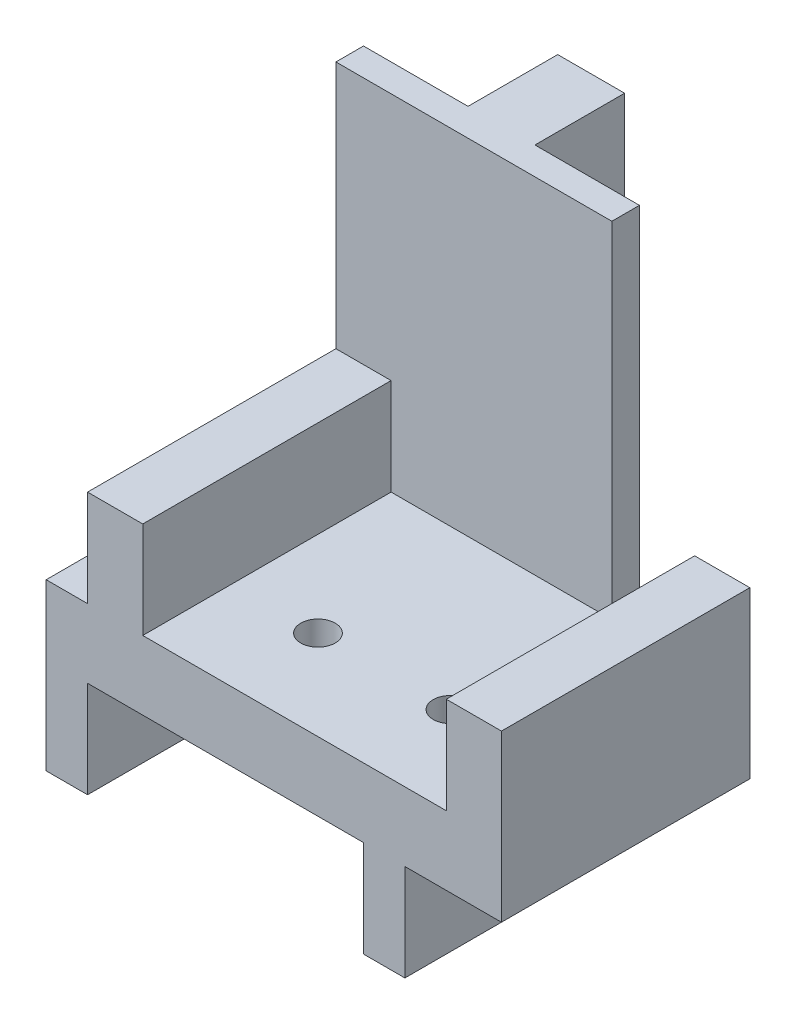
ISO-10303-21;
HEADER;
FILE_DESCRIPTION(('STEP AP214'),'2;1');
FILE_NAME('part.step','',(''),(''),'','','');
FILE_SCHEMA(('AUTOMOTIVE_DESIGN { 1 0 10303 214 1 1 1 1 }'));
ENDSEC;
DATA;
#1=APPLICATION_CONTEXT('core data for automotive mechanical design processes');
#2=APPLICATION_PROTOCOL_DEFINITION('international standard','automotive_design',2000,#1);
#3=PRODUCT_CONTEXT('',#1,'mechanical');
#4=PRODUCT('Part','Part','',(#3));
#5=PRODUCT_RELATED_PRODUCT_CATEGORY('part','',(#4));
#6=PRODUCT_DEFINITION_FORMATION('','',#4);
#7=PRODUCT_DEFINITION_CONTEXT('part definition',#1,'design');
#8=PRODUCT_DEFINITION('design','',#6,#7);
#9=PRODUCT_DEFINITION_SHAPE('','',#8);
#10=(LENGTH_UNIT() NAMED_UNIT(*) SI_UNIT(.MILLI.,.METRE.));
#11=(NAMED_UNIT(*) PLANE_ANGLE_UNIT() SI_UNIT($,.RADIAN.));
#12=(NAMED_UNIT(*) SI_UNIT($,.STERADIAN.) SOLID_ANGLE_UNIT());
#13=UNCERTAINTY_MEASURE_WITH_UNIT(LENGTH_MEASURE(1.E-05),#10,'distance_accuracy_value','');
#14=(GEOMETRIC_REPRESENTATION_CONTEXT(3) GLOBAL_UNCERTAINTY_ASSIGNED_CONTEXT((#13)) GLOBAL_UNIT_ASSIGNED_CONTEXT((#10,
#11,#12)) REPRESENTATION_CONTEXT('',''));
#15=CARTESIAN_POINT('',(0.,0.,0.));
#16=DIRECTION('',(0.,0.,1.));
#17=DIRECTION('',(1.,0.,0.));
#18=AXIS2_PLACEMENT_3D('',#15,#16,#17);
#19=CARTESIAN_POINT('',(5.,5.00000000000001,-2.));
#20=DIRECTION('',(-1.,0.,0.));
#21=DIRECTION('',(0.,-1.,0.));
#22=AXIS2_PLACEMENT_3D('',#19,#20,#21);
#23=PLANE('',#22);
#24=DIRECTION('',(0.,1.,0.));
#25=VECTOR('',#24,1.);
#26=CARTESIAN_POINT('',(5.,-13.,12.7338962679253));
#27=LINE('',#26,#25);
#28=CARTESIAN_POINT('',(5.,-6.99999999999999,12.7338962679253));
#29=VERTEX_POINT('',#28);
#30=CARTESIAN_POINT('',(5.,0.,12.7338962679253));
#31=VERTEX_POINT('',#30);
#32=EDGE_CURVE('E208',#29,#31,#27,.T.);
#33=ORIENTED_EDGE('',*,*,#32,.F.);
#34=DIRECTION('',(0.,0.,1.));
#35=VECTOR('',#34,1.);
#36=CARTESIAN_POINT('',(5.,-6.99999999999999,-2.));
#37=LINE('',#36,#35);
#38=CARTESIAN_POINT('',(5.,-6.99999999999999,18.));
#39=VERTEX_POINT('',#38);
#40=EDGE_CURVE('E217',#29,#39,#37,.T.);
#41=ORIENTED_EDGE('',*,*,#40,.T.);
#42=DIRECTION('',(0.,-1.,0.));
#43=VECTOR('',#42,1.);
#44=CARTESIAN_POINT('',(5.,5.00000000000001,18.));
#45=LINE('',#44,#43);
#46=CARTESIAN_POINT('',(5.,0.,18.));
#47=VERTEX_POINT('',#46);
#48=EDGE_CURVE('E244',#47,#39,#45,.T.);
#49=ORIENTED_EDGE('',*,*,#48,.F.);
#50=DIRECTION('',(0.,0.,1.));
#51=VECTOR('',#50,1.);
#52=CARTESIAN_POINT('',(5.,0.,-2.));
#53=LINE('',#52,#51);
#54=EDGE_CURVE('E219',#31,#47,#53,.T.);
#55=ORIENTED_EDGE('',*,*,#54,.F.);
#56=EDGE_LOOP('',(#33,#41,#49,#55));
#57=FACE_BOUND('',#56,.T.);
#58=ADVANCED_FACE('F37',(#57),#23,.T.);
#59=CARTESIAN_POINT('',(-15.,0.,18.));
#60=DIRECTION('',(0.,1.,0.));
#61=DIRECTION('',(-1.,0.,0.));
#62=AXIS2_PLACEMENT_3D('',#59,#60,#61);
#63=PLANE('',#62);
#64=CARTESIAN_POINT('',(-4.8,0.,11.5));
#65=DIRECTION('',(0.,1.,0.));
#66=DIRECTION('',(-1.,0.,0.));
#67=AXIS2_PLACEMENT_3D('',#64,#65,#66);
#68=CIRCLE('',#67,1.25);
#69=CARTESIAN_POINT('',(-6.05,0.,11.5));
#70=VERTEX_POINT('',#69);
#71=EDGE_CURVE('E233',#70,#70,#68,.T.);
#72=ORIENTED_EDGE('',*,*,#71,.T.);
#73=EDGE_LOOP('',(#72));
#74=FACE_BOUND('',#73,.T.);
#75=CARTESIAN_POINT('',(5.,0.,-2.));
#76=VERTEX_POINT('',#75);
#77=CARTESIAN_POINT('',(5.,0.,10.2661037320747));
#78=VERTEX_POINT('',#77);
#79=EDGE_CURVE('E331',#76,#78,#53,.T.);
#80=ORIENTED_EDGE('',*,*,#79,.T.);
#81=CARTESIAN_POINT('',(4.8,0.,11.5));
#82=DIRECTION('',(0.,1.,0.));
#83=DIRECTION('',(-1.,0.,0.));
#84=AXIS2_PLACEMENT_3D('',#81,#82,#83);
#85=CIRCLE('',#84,1.25);
#86=EDGE_CURVE('E220',#78,#31,#85,.T.);
#87=ORIENTED_EDGE('',*,*,#86,.T.);
#88=ORIENTED_EDGE('',*,*,#54,.T.);
#89=DIRECTION('',(1.,0.,0.));
#90=VECTOR('',#89,1.);
#91=CARTESIAN_POINT('',(-15.,0.,18.));
#92=LINE('',#91,#90);
#93=CARTESIAN_POINT('',(-15.,0.,18.));
#94=VERTEX_POINT('',#93);
#95=EDGE_CURVE('E355',#94,#47,#92,.T.);
#96=ORIENTED_EDGE('',*,*,#95,.F.);
#97=DIRECTION('',(0.,0.,-1.));
#98=VECTOR('',#97,1.);
#99=CARTESIAN_POINT('',(-15.,0.,18.));
#100=LINE('',#99,#98);
#101=CARTESIAN_POINT('',(-15.,0.,-2.));
#102=VERTEX_POINT('',#101);
#103=EDGE_CURVE('E386',#94,#102,#100,.T.);
#104=ORIENTED_EDGE('',*,*,#103,.T.);
#105=DIRECTION('',(-1.,0.,0.));
#106=VECTOR('',#105,1.);
#107=CARTESIAN_POINT('',(-15.,0.,-2.));
#108=LINE('',#107,#106);
#109=CARTESIAN_POINT('',(-7.425,0.,-2.));
#110=VERTEX_POINT('',#109);
#111=EDGE_CURVE('E323',#110,#102,#108,.T.);
#112=ORIENTED_EDGE('',*,*,#111,.F.);
#113=DIRECTION('',(0.,0.,1.));
#114=VECTOR('',#113,1.);
#115=CARTESIAN_POINT('',(-7.425,0.,-8.5));
#116=LINE('',#115,#114);
#117=CARTESIAN_POINT('',(-7.425,0.,-8.5));
#118=VERTEX_POINT('',#117);
#119=EDGE_CURVE('E307',#118,#110,#116,.T.);
#120=ORIENTED_EDGE('',*,*,#119,.F.);
#121=DIRECTION('',(-1.,0.,0.));
#122=VECTOR('',#121,1.);
#123=CARTESIAN_POINT('',(-2.575,0.,-8.5));
#124=LINE('',#123,#122);
#125=CARTESIAN_POINT('',(-2.575,0.,-8.5));
#126=VERTEX_POINT('',#125);
#127=EDGE_CURVE('E290',#126,#118,#124,.T.);
#128=ORIENTED_EDGE('',*,*,#127,.F.);
#129=DIRECTION('',(0.,0.,1.));
#130=VECTOR('',#129,1.);
#131=CARTESIAN_POINT('',(-2.575,0.,-8.5));
#132=LINE('',#131,#130);
#133=CARTESIAN_POINT('',(-2.575,0.,-2.));
#134=VERTEX_POINT('',#133);
#135=EDGE_CURVE('E310',#126,#134,#132,.T.);
#136=ORIENTED_EDGE('',*,*,#135,.T.);
#137=EDGE_CURVE('E324',#76,#134,#108,.T.);
#138=ORIENTED_EDGE('',*,*,#137,.F.);
#139=EDGE_LOOP('',(#80,#87,#88,#96,#104,#112,#120,#128,#136,#138));
#140=FACE_BOUND('',#139,.T.);
#141=ADVANCED_FACE('F438',(#74,#140),#63,.F.);
#142=CARTESIAN_POINT('',(0.,0.,-2.));
#143=DIRECTION('',(0.,0.,-1.));
#144=DIRECTION('',(-1.,0.,0.));
#145=AXIS2_PLACEMENT_3D('',#142,#143,#144);
#146=PLANE('',#145);
#147=DIRECTION('',(0.,-1.,0.));
#148=VECTOR('',#147,1.);
#149=CARTESIAN_POINT('',(-2.575,30.,-2.));
#150=LINE('',#149,#148);
#151=CARTESIAN_POINT('',(-2.575,30.,-2.));
#152=VERTEX_POINT('',#151);
#153=EDGE_CURVE('E281',#152,#134,#150,.T.);
#154=ORIENTED_EDGE('',*,*,#153,.F.);
#155=DIRECTION('',(1.,0.,0.));
#156=VECTOR('',#155,1.);
#157=CARTESIAN_POINT('',(-15.,30.,-2.));
#158=LINE('',#157,#156);
#159=CARTESIAN_POINT('',(5.,30.,-2.));
#160=VERTEX_POINT('',#159);
#161=EDGE_CURVE('E316',#152,#160,#158,.T.);
#162=ORIENTED_EDGE('',*,*,#161,.T.);
#163=DIRECTION('',(0.,-1.,0.));
#164=VECTOR('',#163,1.);
#165=CARTESIAN_POINT('',(5.,0.,-2.));
#166=LINE('',#165,#164);
#167=CARTESIAN_POINT('',(5.,5.00000000000001,-2.));
#168=VERTEX_POINT('',#167);
#169=EDGE_CURVE('E320',#160,#168,#166,.T.);
#170=ORIENTED_EDGE('',*,*,#169,.T.);
#171=DIRECTION('',(-1.,0.,0.));
#172=VECTOR('',#171,1.);
#173=CARTESIAN_POINT('',(5.,5.00000000000001,-2.));
#174=LINE('',#173,#172);
#175=CARTESIAN_POINT('',(8.00000000000001,5.00000000000001,-2.));
#176=VERTEX_POINT('',#175);
#177=EDGE_CURVE('E229',#176,#168,#174,.T.);
#178=ORIENTED_EDGE('',*,*,#177,.F.);
#179=DIRECTION('',(0.,1.,0.));
#180=VECTOR('',#179,1.);
#181=CARTESIAN_POINT('',(8.00000000000001,5.00000000000001,-2.));
#182=LINE('',#181,#180);
#183=CARTESIAN_POINT('',(8.00000000000001,-6.99999999999999,-2.));
#184=VERTEX_POINT('',#183);
#185=EDGE_CURVE('E248',#184,#176,#182,.T.);
#186=ORIENTED_EDGE('',*,*,#185,.F.);
#187=DIRECTION('',(1.,0.,0.));
#188=VECTOR('',#187,1.);
#189=CARTESIAN_POINT('',(5.,-6.99999999999999,-2.));
#190=LINE('',#189,#188);
#191=CARTESIAN_POINT('',(5.,-6.99999999999999,-2.));
#192=VERTEX_POINT('',#191);
#193=EDGE_CURVE('E251',#192,#184,#190,.T.);
#194=ORIENTED_EDGE('',*,*,#193,.F.);
#195=DIRECTION('',(0.,-1.,0.));
#196=VECTOR('',#195,1.);
#197=CARTESIAN_POINT('',(5.,5.00000000000001,-2.));
#198=LINE('',#197,#196);
#199=EDGE_CURVE('E242',#76,#192,#198,.T.);
#200=ORIENTED_EDGE('',*,*,#199,.F.);
#201=ORIENTED_EDGE('',*,*,#137,.T.);
#202=EDGE_LOOP('',(#154,#162,#170,#178,#186,#194,#200,#201));
#203=FACE_BOUND('',#202,.T.);
#204=ADVANCED_FACE('F430',(#203),#146,.T.);
#205=CARTESIAN_POINT('',(11.,12.,18.));
#206=DIRECTION('',(1.,0.,0.));
#207=DIRECTION('',(0.,1.,0.));
#208=AXIS2_PLACEMENT_3D('',#205,#206,#207);
#209=PLANE('',#208);
#210=DIRECTION('',(0.,-1.,0.));
#211=VECTOR('',#210,1.);
#212=CARTESIAN_POINT('',(11.,12.,0.));
#213=LINE('',#212,#211);
#214=CARTESIAN_POINT('',(11.,12.,0.));
#215=VERTEX_POINT('',#214);
#216=CARTESIAN_POINT('',(11.,5.00000000000001,0.));
#217=VERTEX_POINT('',#216);
#218=EDGE_CURVE('E340',#215,#217,#213,.T.);
#219=ORIENTED_EDGE('',*,*,#218,.T.);
#220=DIRECTION('',(0.,0.,-1.));
#221=VECTOR('',#220,1.);
#222=CARTESIAN_POINT('',(11.,5.00000000000001,18.));
#223=LINE('',#222,#221);
#224=CARTESIAN_POINT('',(11.,5.00000000000001,18.));
#225=VERTEX_POINT('',#224);
#226=EDGE_CURVE('E398',#225,#217,#223,.T.);
#227=ORIENTED_EDGE('',*,*,#226,.F.);
#228=DIRECTION('',(0.,-1.,0.));
#229=VECTOR('',#228,1.);
#230=CARTESIAN_POINT('',(11.,12.,18.));
#231=LINE('',#230,#229);
#232=CARTESIAN_POINT('',(11.,12.,18.));
#233=VERTEX_POINT('',#232);
#234=EDGE_CURVE('E341',#233,#225,#231,.T.);
#235=ORIENTED_EDGE('',*,*,#234,.F.);
#236=DIRECTION('',(0.,0.,-1.));
#237=VECTOR('',#236,1.);
#238=CARTESIAN_POINT('',(11.,12.,18.));
#239=LINE('',#238,#237);
#240=EDGE_CURVE('E362',#233,#215,#239,.T.);
#241=ORIENTED_EDGE('',*,*,#240,.T.);
#242=EDGE_LOOP('',(#219,#227,#235,#241));
#243=FACE_BOUND('',#242,.T.);
#244=ADVANCED_FACE('F39',(#243),#209,.F.);
#245=CARTESIAN_POINT('',(11.,5.00000000000001,18.));
#246=DIRECTION('',(0.,-1.,0.));
#247=DIRECTION('',(1.,0.,0.));
#248=AXIS2_PLACEMENT_3D('',#245,#246,#247);
#249=PLANE('',#248);
#250=CARTESIAN_POINT('',(-4.8,5.00000000000001,11.5));
#251=DIRECTION('',(0.,1.,0.));
#252=DIRECTION('',(-1.,0.,0.));
#253=AXIS2_PLACEMENT_3D('',#250,#251,#252);
#254=CIRCLE('',#253,1.25);
#255=CARTESIAN_POINT('',(-6.05,5.00000000000001,11.5));
#256=VERTEX_POINT('',#255);
#257=EDGE_CURVE('E694',#256,#256,#254,.T.);
#258=ORIENTED_EDGE('',*,*,#257,.F.);
#259=EDGE_LOOP('',(#258));
#260=FACE_BOUND('',#259,.T.);
#261=CARTESIAN_POINT('',(4.8,5.00000000000001,11.5));
#262=DIRECTION('',(0.,1.,0.));
#263=DIRECTION('',(1.,0.,0.));
#264=AXIS2_PLACEMENT_3D('',#261,#262,#263);
#265=CIRCLE('',#264,1.25);
#266=CARTESIAN_POINT('',(6.05,5.00000000000001,11.5));
#267=VERTEX_POINT('',#266);
#268=EDGE_CURVE('E699',#267,#267,#265,.T.);
#269=ORIENTED_EDGE('',*,*,#268,.F.);
#270=EDGE_LOOP('',(#269));
#271=FACE_BOUND('',#270,.T.);
#272=DIRECTION('',(-1.,0.,0.));
#273=VECTOR('',#272,1.);
#274=CARTESIAN_POINT('',(11.,5.00000000000001,0.));
#275=LINE('',#274,#273);
#276=CARTESIAN_POINT('',(8.00000000000001,5.00000000000001,0.));
#277=VERTEX_POINT('',#276);
#278=EDGE_CURVE('E366',#217,#277,#275,.T.);
#279=ORIENTED_EDGE('',*,*,#278,.T.);
#280=DIRECTION('',(0.,0.,1.));
#281=VECTOR('',#280,1.);
#282=CARTESIAN_POINT('',(8.00000000000001,5.00000000000001,-2.));
#283=LINE('',#282,#281);
#284=EDGE_CURVE('E230',#176,#277,#283,.T.);
#285=ORIENTED_EDGE('',*,*,#284,.F.);
#286=ORIENTED_EDGE('',*,*,#177,.T.);
#287=DIRECTION('',(0.,0.,1.));
#288=VECTOR('',#287,1.);
#289=CARTESIAN_POINT('',(5.,5.00000000000001,-2.));
#290=LINE('',#289,#288);
#291=CARTESIAN_POINT('',(5.,5.00000000000001,0.));
#292=VERTEX_POINT('',#291);
#293=EDGE_CURVE('E237',#168,#292,#290,.T.);
#294=ORIENTED_EDGE('',*,*,#293,.T.);
#295=CARTESIAN_POINT('',(-11.,5.,0.));
#296=VERTEX_POINT('',#295);
#297=EDGE_CURVE('E365',#292,#296,#275,.T.);
#298=ORIENTED_EDGE('',*,*,#297,.T.);
#299=DIRECTION('',(0.,0.,-1.));
#300=VECTOR('',#299,1.);
#301=CARTESIAN_POINT('',(-11.,5.,18.));
#302=LINE('',#301,#300);
#303=CARTESIAN_POINT('',(-11.,5.,18.));
#304=VERTEX_POINT('',#303);
#305=EDGE_CURVE('E395',#304,#296,#302,.T.);
#306=ORIENTED_EDGE('',*,*,#305,.F.);
#307=DIRECTION('',(-1.,0.,0.));
#308=VECTOR('',#307,1.);
#309=CARTESIAN_POINT('',(11.,5.00000000000001,18.));
#310=LINE('',#309,#308);
#311=EDGE_CURVE('E344',#225,#304,#310,.T.);
#312=ORIENTED_EDGE('',*,*,#311,.F.);
#313=ORIENTED_EDGE('',*,*,#226,.T.);
#314=EDGE_LOOP('',(#279,#285,#286,#294,#298,#306,#312,#313));
#315=FACE_BOUND('',#314,.T.);
#316=ADVANCED_FACE('F455',(#260,#271,#315),#249,.F.);
#317=CARTESIAN_POINT('',(-11.,5.,18.));
#318=DIRECTION('',(-1.,0.,0.));
#319=DIRECTION('',(0.,0.,1.));
#320=AXIS2_PLACEMENT_3D('',#317,#318,#319);
#321=PLANE('',#320);
#322=DIRECTION('',(0.,1.,0.));
#323=VECTOR('',#322,1.);
#324=CARTESIAN_POINT('',(-11.,5.,0.));
#325=LINE('',#324,#323);
#326=CARTESIAN_POINT('',(-11.,12.,0.));
#327=VERTEX_POINT('',#326);
#328=EDGE_CURVE('E369',#296,#327,#325,.T.);
#329=ORIENTED_EDGE('',*,*,#328,.T.);
#330=DIRECTION('',(0.,0.,-1.));
#331=VECTOR('',#330,1.);
#332=CARTESIAN_POINT('',(-11.,12.,18.));
#333=LINE('',#332,#331);
#334=CARTESIAN_POINT('',(-11.,12.,18.));
#335=VERTEX_POINT('',#334);
#336=EDGE_CURVE('E392',#335,#327,#333,.T.);
#337=ORIENTED_EDGE('',*,*,#336,.F.);
#338=DIRECTION('',(0.,1.,0.));
#339=VECTOR('',#338,1.);
#340=CARTESIAN_POINT('',(-11.,5.,18.));
#341=LINE('',#340,#339);
#342=EDGE_CURVE('E347',#304,#335,#341,.T.);
#343=ORIENTED_EDGE('',*,*,#342,.F.);
#344=ORIENTED_EDGE('',*,*,#305,.T.);
#345=EDGE_LOOP('',(#329,#337,#343,#344));
#346=FACE_BOUND('',#345,.T.);
#347=ADVANCED_FACE('F465',(#346),#321,.F.);
#348=CARTESIAN_POINT('',(-11.,12.,18.));
#349=DIRECTION('',(0.,-1.,0.));
#350=DIRECTION('',(1.,0.,0.));
#351=AXIS2_PLACEMENT_3D('',#348,#349,#350);
#352=PLANE('',#351);
#353=DIRECTION('',(-1.,0.,0.));
#354=VECTOR('',#353,1.);
#355=CARTESIAN_POINT('',(-11.,12.,0.));
#356=LINE('',#355,#354);
#357=CARTESIAN_POINT('',(-15.,12.,0.));
#358=VERTEX_POINT('',#357);
#359=EDGE_CURVE('E371',#327,#358,#356,.T.);
#360=ORIENTED_EDGE('',*,*,#359,.T.);
#361=DIRECTION('',(0.,0.,-1.));
#362=VECTOR('',#361,1.);
#363=CARTESIAN_POINT('',(-15.,12.,18.));
#364=LINE('',#363,#362);
#365=CARTESIAN_POINT('',(-15.,12.,18.));
#366=VERTEX_POINT('',#365);
#367=EDGE_CURVE('E389',#366,#358,#364,.T.);
#368=ORIENTED_EDGE('',*,*,#367,.F.);
#369=DIRECTION('',(-1.,0.,0.));
#370=VECTOR('',#369,1.);
#371=CARTESIAN_POINT('',(-11.,12.,18.));
#372=LINE('',#371,#370);
#373=EDGE_CURVE('E349',#335,#366,#372,.T.);
#374=ORIENTED_EDGE('',*,*,#373,.F.);
#375=ORIENTED_EDGE('',*,*,#336,.T.);
#376=EDGE_LOOP('',(#360,#368,#374,#375));
#377=FACE_BOUND('',#376,.T.);
#378=ADVANCED_FACE('F469',(#377),#352,.F.);
#379=CARTESIAN_POINT('',(-15.,12.,18.));
#380=DIRECTION('',(1.,0.,0.));
#381=DIRECTION('',(0.,1.,0.));
#382=AXIS2_PLACEMENT_3D('',#379,#380,#381);
#383=PLANE('',#382);
#384=DIRECTION('',(0.,1.,0.));
#385=VECTOR('',#384,1.);
#386=CARTESIAN_POINT('',(-15.,0.,-2.));
#387=LINE('',#386,#385);
#388=CARTESIAN_POINT('',(-15.,5.00000000000001,-2.));
#389=VERTEX_POINT('',#388);
#390=CARTESIAN_POINT('',(-15.,30.,-2.));
#391=VERTEX_POINT('',#390);
#392=EDGE_CURVE('E314',#389,#391,#387,.T.);
#393=ORIENTED_EDGE('',*,*,#392,.F.);
#394=DIRECTION('',(0.,0.,1.));
#395=VECTOR('',#394,1.);
#396=CARTESIAN_POINT('',(-15.,5.00000000000001,-2.));
#397=LINE('',#396,#395);
#398=CARTESIAN_POINT('',(-15.,5.00000000000001,18.));
#399=VERTEX_POINT('',#398);
#400=EDGE_CURVE('E270',#389,#399,#397,.T.);
#401=ORIENTED_EDGE('',*,*,#400,.T.);
#402=DIRECTION('',(0.,-1.,0.));
#403=VECTOR('',#402,1.);
#404=CARTESIAN_POINT('',(-15.,12.,18.));
#405=LINE('',#404,#403);
#406=EDGE_CURVE('E351',#366,#399,#405,.T.);
#407=ORIENTED_EDGE('',*,*,#406,.F.);
#408=ORIENTED_EDGE('',*,*,#367,.T.);
#409=DIRECTION('',(0.,1.,0.));
#410=VECTOR('',#409,1.);
#411=CARTESIAN_POINT('',(-15.,0.,0.));
#412=LINE('',#411,#410);
#413=CARTESIAN_POINT('',(-15.,30.,0.));
#414=VERTEX_POINT('',#413);
#415=EDGE_CURVE('E313',#358,#414,#412,.T.);
#416=ORIENTED_EDGE('',*,*,#415,.T.);
#417=DIRECTION('',(0.,0.,1.));
#418=VECTOR('',#417,1.);
#419=CARTESIAN_POINT('',(-15.,30.,-2.));
#420=LINE('',#419,#418);
#421=EDGE_CURVE('E337',#391,#414,#420,.T.);
#422=ORIENTED_EDGE('',*,*,#421,.F.);
#423=EDGE_LOOP('',(#393,#401,#407,#408,#416,#422));
#424=FACE_BOUND('',#423,.T.);
#425=ADVANCED_FACE('F538',(#424),#383,.F.);
#426=CARTESIAN_POINT('',(8.00000000000001,0.,18.));
#427=VERTEX_POINT('',#426);
#428=CARTESIAN_POINT('',(15.,0.,18.));
#429=VERTEX_POINT('',#428);
#430=EDGE_CURVE('E354',#427,#429,#92,.T.);
#431=ORIENTED_EDGE('',*,*,#430,.F.);
#432=DIRECTION('',(0.,0.,-1.));
#433=VECTOR('',#432,1.);
#434=CARTESIAN_POINT('',(8.00000000000001,0.,18.));
#435=LINE('',#434,#433);
#436=CARTESIAN_POINT('',(8.00000000000001,0.,0.));
#437=VERTEX_POINT('',#436);
#438=EDGE_CURVE('E246',#427,#437,#435,.T.);
#439=ORIENTED_EDGE('',*,*,#438,.T.);
#440=DIRECTION('',(1.,0.,0.));
#441=VECTOR('',#440,1.);
#442=CARTESIAN_POINT('',(-15.,0.,0.));
#443=LINE('',#442,#441);
#444=CARTESIAN_POINT('',(15.,0.,0.));
#445=VERTEX_POINT('',#444);
#446=EDGE_CURVE('E373',#437,#445,#443,.T.);
#447=ORIENTED_EDGE('',*,*,#446,.T.);
#448=DIRECTION('',(0.,0.,-1.));
#449=VECTOR('',#448,1.);
#450=CARTESIAN_POINT('',(15.,0.,18.));
#451=LINE('',#450,#449);
#452=EDGE_CURVE('E383',#429,#445,#451,.T.);
#453=ORIENTED_EDGE('',*,*,#452,.F.);
#454=EDGE_LOOP('',(#431,#439,#447,#453));
#455=FACE_BOUND('',#454,.T.);
#456=ADVANCED_FACE('F408',(#455),#63,.F.);
#457=CARTESIAN_POINT('',(15.,0.,18.));
#458=DIRECTION('',(-1.,0.,0.));
#459=DIRECTION('',(0.,-1.,0.));
#460=AXIS2_PLACEMENT_3D('',#457,#458,#459);
#461=PLANE('',#460);
#462=DIRECTION('',(0.,1.,0.));
#463=VECTOR('',#462,1.);
#464=CARTESIAN_POINT('',(15.,0.,0.));
#465=LINE('',#464,#463);
#466=CARTESIAN_POINT('',(15.,12.,0.));
#467=VERTEX_POINT('',#466);
#468=EDGE_CURVE('E375',#445,#467,#465,.T.);
#469=ORIENTED_EDGE('',*,*,#468,.T.);
#470=DIRECTION('',(0.,0.,-1.));
#471=VECTOR('',#470,1.);
#472=CARTESIAN_POINT('',(15.,12.,18.));
#473=LINE('',#472,#471);
#474=CARTESIAN_POINT('',(15.,12.,18.));
#475=VERTEX_POINT('',#474);
#476=EDGE_CURVE('E380',#475,#467,#473,.T.);
#477=ORIENTED_EDGE('',*,*,#476,.F.);
#478=DIRECTION('',(0.,1.,0.));
#479=VECTOR('',#478,1.);
#480=CARTESIAN_POINT('',(15.,0.,18.));
#481=LINE('',#480,#479);
#482=EDGE_CURVE('E358',#429,#475,#481,.T.);
#483=ORIENTED_EDGE('',*,*,#482,.F.);
#484=ORIENTED_EDGE('',*,*,#452,.T.);
#485=EDGE_LOOP('',(#469,#477,#483,#484));
#486=FACE_BOUND('',#485,.T.);
#487=ADVANCED_FACE('F416',(#486),#461,.F.);
#488=CARTESIAN_POINT('',(15.,12.,18.));
#489=DIRECTION('',(0.,-1.,0.));
#490=DIRECTION('',(1.,0.,0.));
#491=AXIS2_PLACEMENT_3D('',#488,#489,#490);
#492=PLANE('',#491);
#493=DIRECTION('',(-1.,0.,0.));
#494=VECTOR('',#493,1.);
#495=CARTESIAN_POINT('',(15.,12.,0.));
#496=LINE('',#495,#494);
#497=EDGE_CURVE('E345',#467,#215,#496,.T.);
#498=ORIENTED_EDGE('',*,*,#497,.T.);
#499=ORIENTED_EDGE('',*,*,#240,.F.);
#500=DIRECTION('',(-1.,0.,0.));
#501=VECTOR('',#500,1.);
#502=CARTESIAN_POINT('',(15.,12.,18.));
#503=LINE('',#502,#501);
#504=EDGE_CURVE('E360',#475,#233,#503,.T.);
#505=ORIENTED_EDGE('',*,*,#504,.F.);
#506=ORIENTED_EDGE('',*,*,#476,.T.);
#507=EDGE_LOOP('',(#498,#499,#505,#506));
#508=FACE_BOUND('',#507,.T.);
#509=ADVANCED_FACE('F420',(#508),#492,.F.);
#510=CARTESIAN_POINT('',(0.,0.,18.));
#511=DIRECTION('',(0.,0.,-1.));
#512=DIRECTION('',(-1.,0.,0.));
#513=AXIS2_PLACEMENT_3D('',#510,#511,#512);
#514=PLANE('',#513);
#515=ORIENTED_EDGE('',*,*,#311,.T.);
#516=ORIENTED_EDGE('',*,*,#342,.T.);
#517=ORIENTED_EDGE('',*,*,#373,.T.);
#518=ORIENTED_EDGE('',*,*,#406,.T.);
#519=DIRECTION('',(-1.,0.,0.));
#520=VECTOR('',#519,1.);
#521=CARTESIAN_POINT('',(-15.,5.00000000000001,18.));
#522=LINE('',#521,#520);
#523=CARTESIAN_POINT('',(-18.,5.00000000000001,18.));
#524=VERTEX_POINT('',#523);
#525=EDGE_CURVE('E59',#399,#524,#522,.T.);
#526=ORIENTED_EDGE('',*,*,#525,.T.);
#527=DIRECTION('',(0.,-1.,0.));
#528=VECTOR('',#527,1.);
#529=CARTESIAN_POINT('',(-18.,5.00000000000001,18.));
#530=LINE('',#529,#528);
#531=CARTESIAN_POINT('',(-18.,-6.99999999999999,18.));
#532=VERTEX_POINT('',#531);
#533=EDGE_CURVE('E274',#524,#532,#530,.T.);
#534=ORIENTED_EDGE('',*,*,#533,.T.);
#535=DIRECTION('',(1.,0.,0.));
#536=VECTOR('',#535,1.);
#537=CARTESIAN_POINT('',(-15.,-6.99999999999999,18.));
#538=LINE('',#537,#536);
#539=CARTESIAN_POINT('',(-15.,-6.99999999999999,18.));
#540=VERTEX_POINT('',#539);
#541=EDGE_CURVE('E261',#532,#540,#538,.T.);
#542=ORIENTED_EDGE('',*,*,#541,.T.);
#543=DIRECTION('',(0.,1.,0.));
#544=VECTOR('',#543,1.);
#545=CARTESIAN_POINT('',(-15.,5.00000000000001,18.));
#546=LINE('',#545,#544);
#547=EDGE_CURVE('E257',#540,#94,#546,.T.);
#548=ORIENTED_EDGE('',*,*,#547,.T.);
#549=ORIENTED_EDGE('',*,*,#95,.T.);
#550=ORIENTED_EDGE('',*,*,#48,.T.);
#551=DIRECTION('',(1.,0.,0.));
#552=VECTOR('',#551,1.);
#553=CARTESIAN_POINT('',(5.,-6.99999999999999,18.));
#554=LINE('',#553,#552);
#555=CARTESIAN_POINT('',(8.00000000000001,-6.99999999999999,18.));
#556=VERTEX_POINT('',#555);
#557=EDGE_CURVE('E225',#39,#556,#554,.T.);
#558=ORIENTED_EDGE('',*,*,#557,.T.);
#559=DIRECTION('',(0.,1.,0.));
#560=VECTOR('',#559,1.);
#561=CARTESIAN_POINT('',(8.00000000000001,5.00000000000001,18.));
#562=LINE('',#561,#560);
#563=EDGE_CURVE('E239',#556,#427,#562,.T.);
#564=ORIENTED_EDGE('',*,*,#563,.T.);
#565=ORIENTED_EDGE('',*,*,#430,.T.);
#566=ORIENTED_EDGE('',*,*,#482,.T.);
#567=ORIENTED_EDGE('',*,*,#504,.T.);
#568=ORIENTED_EDGE('',*,*,#234,.T.);
#569=EDGE_LOOP('',(#515,#516,#517,#518,#526,#534,#542,#548,#549,#550,#558,#564,#565,#566,#567,#568));
#570=FACE_BOUND('',#569,.T.);
#571=ADVANCED_FACE('F424',(#570),#514,.F.);
#572=CARTESIAN_POINT('',(0.,0.,0.));
#573=DIRECTION('',(0.,0.,-1.));
#574=DIRECTION('',(-1.,0.,0.));
#575=AXIS2_PLACEMENT_3D('',#572,#573,#574);
#576=PLANE('',#575);
#577=DIRECTION('',(0.,-1.,0.));
#578=VECTOR('',#577,1.);
#579=CARTESIAN_POINT('',(8.00000000000001,0.,0.));
#580=LINE('',#579,#578);
#581=EDGE_CURVE('E45',#277,#437,#580,.T.);
#582=ORIENTED_EDGE('',*,*,#581,.F.);
#583=ORIENTED_EDGE('',*,*,#278,.F.);
#584=ORIENTED_EDGE('',*,*,#218,.F.);
#585=ORIENTED_EDGE('',*,*,#497,.F.);
#586=ORIENTED_EDGE('',*,*,#468,.F.);
#587=ORIENTED_EDGE('',*,*,#446,.F.);
#588=EDGE_LOOP('',(#582,#583,#584,#585,#586,#587));
#589=FACE_BOUND('',#588,.T.);
#590=ADVANCED_FACE('F411',(#589),#576,.T.);
#591=CARTESIAN_POINT('',(-15.,30.,-2.));
#592=DIRECTION('',(0.,-1.,0.));
#593=DIRECTION('',(1.,0.,0.));
#594=AXIS2_PLACEMENT_3D('',#591,#592,#593);
#595=PLANE('',#594);
#596=DIRECTION('',(1.,0.,0.));
#597=VECTOR('',#596,1.);
#598=CARTESIAN_POINT('',(-15.,30.,0.));
#599=LINE('',#598,#597);
#600=CARTESIAN_POINT('',(5.,30.,0.));
#601=VERTEX_POINT('',#600);
#602=EDGE_CURVE('E327',#414,#601,#599,.T.);
#603=ORIENTED_EDGE('',*,*,#602,.T.);
#604=DIRECTION('',(0.,0.,1.));
#605=VECTOR('',#604,1.);
#606=CARTESIAN_POINT('',(5.,30.,-2.));
#607=LINE('',#606,#605);
#608=EDGE_CURVE('E334',#160,#601,#607,.T.);
#609=ORIENTED_EDGE('',*,*,#608,.F.);
#610=ORIENTED_EDGE('',*,*,#161,.F.);
#611=DIRECTION('',(0.,0.,1.));
#612=VECTOR('',#611,1.);
#613=CARTESIAN_POINT('',(-2.575,30.,-8.5));
#614=LINE('',#613,#612);
#615=CARTESIAN_POINT('',(-2.575,30.,-8.5));
#616=VERTEX_POINT('',#615);
#617=EDGE_CURVE('E297',#616,#152,#614,.T.);
#618=ORIENTED_EDGE('',*,*,#617,.F.);
#619=DIRECTION('',(1.,0.,0.));
#620=VECTOR('',#619,1.);
#621=CARTESIAN_POINT('',(-2.575,30.,-8.5));
#622=LINE('',#621,#620);
#623=CARTESIAN_POINT('',(-7.425,30.,-8.5));
#624=VERTEX_POINT('',#623);
#625=EDGE_CURVE('E295',#624,#616,#622,.T.);
#626=ORIENTED_EDGE('',*,*,#625,.F.);
#627=DIRECTION('',(0.,0.,1.));
#628=VECTOR('',#627,1.);
#629=CARTESIAN_POINT('',(-7.425,30.,-8.5));
#630=LINE('',#629,#628);
#631=CARTESIAN_POINT('',(-7.425,30.,-2.));
#632=VERTEX_POINT('',#631);
#633=EDGE_CURVE('E304',#624,#632,#630,.T.);
#634=ORIENTED_EDGE('',*,*,#633,.T.);
#635=EDGE_CURVE('E318',#391,#632,#158,.T.);
#636=ORIENTED_EDGE('',*,*,#635,.F.);
#637=ORIENTED_EDGE('',*,*,#421,.T.);
#638=EDGE_LOOP('',(#603,#609,#610,#618,#626,#634,#636,#637));
#639=FACE_BOUND('',#638,.T.);
#640=ADVANCED_FACE('F446',(#639),#595,.F.);
#641=CARTESIAN_POINT('',(5.,0.,-2.));
#642=DIRECTION('',(-1.,0.,0.));
#643=DIRECTION('',(0.,0.,1.));
#644=AXIS2_PLACEMENT_3D('',#641,#642,#643);
#645=PLANE('',#644);
#646=DIRECTION('',(0.,-1.,0.));
#647=VECTOR('',#646,1.);
#648=CARTESIAN_POINT('',(5.,0.,0.));
#649=LINE('',#648,#647);
#650=EDGE_CURVE('E317',#601,#292,#649,.T.);
#651=ORIENTED_EDGE('',*,*,#650,.T.);
#652=ORIENTED_EDGE('',*,*,#293,.F.);
#653=ORIENTED_EDGE('',*,*,#169,.F.);
#654=ORIENTED_EDGE('',*,*,#608,.T.);
#655=EDGE_LOOP('',(#651,#652,#653,#654));
#656=FACE_BOUND('',#655,.T.);
#657=ADVANCED_FACE('F451',(#656),#645,.F.);
#658=DIRECTION('',(0.,1.,0.));
#659=VECTOR('',#658,1.);
#660=CARTESIAN_POINT('',(-7.425,30.,-2.));
#661=LINE('',#660,#659);
#662=EDGE_CURVE('E291',#110,#632,#661,.T.);
#663=ORIENTED_EDGE('',*,*,#662,.F.);
#664=ORIENTED_EDGE('',*,*,#111,.T.);
#665=DIRECTION('',(0.,1.,0.));
#666=VECTOR('',#665,1.);
#667=CARTESIAN_POINT('',(-15.,5.00000000000001,-2.));
#668=LINE('',#667,#666);
#669=CARTESIAN_POINT('',(-15.,-6.99999999999999,-2.));
#670=VERTEX_POINT('',#669);
#671=EDGE_CURVE('E258',#670,#102,#668,.T.);
#672=ORIENTED_EDGE('',*,*,#671,.F.);
#673=DIRECTION('',(1.,0.,0.));
#674=VECTOR('',#673,1.);
#675=CARTESIAN_POINT('',(-15.,-6.99999999999999,-2.));
#676=LINE('',#675,#674);
#677=CARTESIAN_POINT('',(-18.,-6.99999999999999,-2.));
#678=VERTEX_POINT('',#677);
#679=EDGE_CURVE('E267',#678,#670,#676,.T.);
#680=ORIENTED_EDGE('',*,*,#679,.F.);
#681=DIRECTION('',(0.,-1.,0.));
#682=VECTOR('',#681,1.);
#683=CARTESIAN_POINT('',(-18.,5.00000000000001,-2.));
#684=LINE('',#683,#682);
#685=CARTESIAN_POINT('',(-18.,5.00000000000001,-2.));
#686=VERTEX_POINT('',#685);
#687=EDGE_CURVE('E264',#686,#678,#684,.T.);
#688=ORIENTED_EDGE('',*,*,#687,.F.);
#689=DIRECTION('',(-1.,0.,0.));
#690=VECTOR('',#689,1.);
#691=CARTESIAN_POINT('',(-15.,5.00000000000001,-2.));
#692=LINE('',#691,#690);
#693=EDGE_CURVE('E260',#389,#686,#692,.T.);
#694=ORIENTED_EDGE('',*,*,#693,.F.);
#695=ORIENTED_EDGE('',*,*,#392,.T.);
#696=ORIENTED_EDGE('',*,*,#635,.T.);
#697=EDGE_LOOP('',(#663,#664,#672,#680,#688,#694,#695,#696));
#698=FACE_BOUND('',#697,.T.);
#699=ADVANCED_FACE('F480',(#698),#146,.T.);
#700=CARTESIAN_POINT('',(0.,0.,0.));
#701=DIRECTION('',(0.,0.,-1.));
#702=DIRECTION('',(-1.,0.,0.));
#703=AXIS2_PLACEMENT_3D('',#700,#701,#702);
#704=PLANE('',#703);
#705=ORIENTED_EDGE('',*,*,#359,.F.);
#706=ORIENTED_EDGE('',*,*,#328,.F.);
#707=ORIENTED_EDGE('',*,*,#297,.F.);
#708=ORIENTED_EDGE('',*,*,#650,.F.);
#709=ORIENTED_EDGE('',*,*,#602,.F.);
#710=ORIENTED_EDGE('',*,*,#415,.F.);
#711=EDGE_LOOP('',(#705,#706,#707,#708,#709,#710));
#712=FACE_BOUND('',#711,.T.);
#713=ADVANCED_FACE('F460',(#712),#704,.F.);
#714=CARTESIAN_POINT('',(-2.575,30.,-8.5));
#715=DIRECTION('',(-1.,0.,0.));
#716=DIRECTION('',(0.,-1.,0.));
#717=AXIS2_PLACEMENT_3D('',#714,#715,#716);
#718=PLANE('',#717);
#719=ORIENTED_EDGE('',*,*,#153,.T.);
#720=ORIENTED_EDGE('',*,*,#135,.F.);
#721=DIRECTION('',(0.,-1.,0.));
#722=VECTOR('',#721,1.);
#723=CARTESIAN_POINT('',(-2.575,30.,-8.5));
#724=LINE('',#723,#722);
#725=EDGE_CURVE('E287',#616,#126,#724,.T.);
#726=ORIENTED_EDGE('',*,*,#725,.F.);
#727=ORIENTED_EDGE('',*,*,#617,.T.);
#728=EDGE_LOOP('',(#719,#720,#726,#727));
#729=FACE_BOUND('',#728,.T.);
#730=ADVANCED_FACE('F442',(#729),#718,.F.);
#731=CARTESIAN_POINT('',(-7.425,30.,-8.5));
#732=DIRECTION('',(1.,0.,0.));
#733=DIRECTION('',(0.,1.,0.));
#734=AXIS2_PLACEMENT_3D('',#731,#732,#733);
#735=PLANE('',#734);
#736=ORIENTED_EDGE('',*,*,#662,.T.);
#737=ORIENTED_EDGE('',*,*,#633,.F.);
#738=DIRECTION('',(0.,1.,0.));
#739=VECTOR('',#738,1.);
#740=CARTESIAN_POINT('',(-7.425,30.,-8.5));
#741=LINE('',#740,#739);
#742=EDGE_CURVE('E293',#118,#624,#741,.T.);
#743=ORIENTED_EDGE('',*,*,#742,.F.);
#744=ORIENTED_EDGE('',*,*,#119,.T.);
#745=EDGE_LOOP('',(#736,#737,#743,#744));
#746=FACE_BOUND('',#745,.T.);
#747=ADVANCED_FACE('F514',(#746),#735,.F.);
#748=CARTESIAN_POINT('',(0.,0.,-8.5));
#749=DIRECTION('',(0.,0.,-1.));
#750=DIRECTION('',(-1.,0.,0.));
#751=AXIS2_PLACEMENT_3D('',#748,#749,#750);
#752=PLANE('',#751);
#753=ORIENTED_EDGE('',*,*,#725,.T.);
#754=ORIENTED_EDGE('',*,*,#127,.T.);
#755=ORIENTED_EDGE('',*,*,#742,.T.);
#756=ORIENTED_EDGE('',*,*,#625,.T.);
#757=EDGE_LOOP('',(#753,#754,#755,#756));
#758=FACE_BOUND('',#757,.T.);
#759=ADVANCED_FACE('F510',(#758),#752,.T.);
#760=CARTESIAN_POINT('',(-15.,5.00000000000001,-2.));
#761=DIRECTION('',(1.,0.,0.));
#762=DIRECTION('',(0.,1.,0.));
#763=AXIS2_PLACEMENT_3D('',#760,#761,#762);
#764=PLANE('',#763);
#765=ORIENTED_EDGE('',*,*,#103,.F.);
#766=ORIENTED_EDGE('',*,*,#547,.F.);
#767=DIRECTION('',(0.,0.,1.));
#768=VECTOR('',#767,1.);
#769=CARTESIAN_POINT('',(-15.,-6.99999999999999,-2.));
#770=LINE('',#769,#768);
#771=EDGE_CURVE('E279',#670,#540,#770,.T.);
#772=ORIENTED_EDGE('',*,*,#771,.F.);
#773=ORIENTED_EDGE('',*,*,#671,.T.);
#774=EDGE_LOOP('',(#765,#766,#772,#773));
#775=FACE_BOUND('',#774,.T.);
#776=ADVANCED_FACE('F507',(#775),#764,.T.);
#777=CARTESIAN_POINT('',(-15.,-6.99999999999999,-2.));
#778=DIRECTION('',(0.,-1.,0.));
#779=DIRECTION('',(1.,0.,0.));
#780=AXIS2_PLACEMENT_3D('',#777,#778,#779);
#781=PLANE('',#780);
#782=ORIENTED_EDGE('',*,*,#541,.F.);
#783=DIRECTION('',(0.,0.,1.));
#784=VECTOR('',#783,1.);
#785=CARTESIAN_POINT('',(-18.,-6.99999999999999,-2.));
#786=LINE('',#785,#784);
#787=EDGE_CURVE('E282',#678,#532,#786,.T.);
#788=ORIENTED_EDGE('',*,*,#787,.F.);
#789=ORIENTED_EDGE('',*,*,#679,.T.);
#790=ORIENTED_EDGE('',*,*,#771,.T.);
#791=EDGE_LOOP('',(#782,#788,#789,#790));
#792=FACE_BOUND('',#791,.T.);
#793=ADVANCED_FACE('F502',(#792),#781,.T.);
#794=CARTESIAN_POINT('',(-18.,5.00000000000001,-2.));
#795=DIRECTION('',(-1.,0.,0.));
#796=DIRECTION('',(0.,-1.,0.));
#797=AXIS2_PLACEMENT_3D('',#794,#795,#796);
#798=PLANE('',#797);
#799=ORIENTED_EDGE('',*,*,#533,.F.);
#800=DIRECTION('',(0.,0.,1.));
#801=VECTOR('',#800,1.);
#802=CARTESIAN_POINT('',(-18.,5.00000000000001,-2.));
#803=LINE('',#802,#801);
#804=EDGE_CURVE('E284',#686,#524,#803,.T.);
#805=ORIENTED_EDGE('',*,*,#804,.F.);
#806=ORIENTED_EDGE('',*,*,#687,.T.);
#807=ORIENTED_EDGE('',*,*,#787,.T.);
#808=EDGE_LOOP('',(#799,#805,#806,#807));
#809=FACE_BOUND('',#808,.T.);
#810=ADVANCED_FACE('F497',(#809),#798,.T.);
#811=CARTESIAN_POINT('',(-15.,5.00000000000001,-2.));
#812=DIRECTION('',(0.,1.,0.));
#813=DIRECTION('',(-1.,0.,0.));
#814=AXIS2_PLACEMENT_3D('',#811,#812,#813);
#815=PLANE('',#814);
#816=ORIENTED_EDGE('',*,*,#525,.F.);
#817=ORIENTED_EDGE('',*,*,#400,.F.);
#818=ORIENTED_EDGE('',*,*,#693,.T.);
#819=ORIENTED_EDGE('',*,*,#804,.T.);
#820=EDGE_LOOP('',(#816,#817,#818,#819));
#821=FACE_BOUND('',#820,.T.);
#822=ADVANCED_FACE('F491',(#821),#815,.T.);
#823=DIRECTION('',(0.,1.,0.));
#824=VECTOR('',#823,1.);
#825=CARTESIAN_POINT('',(5.,-13.,10.2661037320747));
#826=LINE('',#825,#824);
#827=CARTESIAN_POINT('',(5.,-6.99999999999999,10.2661037320747));
#828=VERTEX_POINT('',#827);
#829=EDGE_CURVE('E51',#78,#828,#826,.F.);
#830=ORIENTED_EDGE('',*,*,#829,.F.);
#831=ORIENTED_EDGE('',*,*,#79,.F.);
#832=ORIENTED_EDGE('',*,*,#199,.T.);
#833=EDGE_CURVE('E226',#192,#828,#37,.T.);
#834=ORIENTED_EDGE('',*,*,#833,.T.);
#835=EDGE_LOOP('',(#830,#831,#832,#834));
#836=FACE_BOUND('',#835,.T.);
#837=ADVANCED_FACE('F432',(#836),#23,.T.);
#838=CARTESIAN_POINT('',(8.00000000000001,5.00000000000001,-2.));
#839=DIRECTION('',(1.,0.,0.));
#840=DIRECTION('',(0.,0.,-1.));
#841=AXIS2_PLACEMENT_3D('',#838,#839,#840);
#842=PLANE('',#841);
#843=ORIENTED_EDGE('',*,*,#438,.F.);
#844=ORIENTED_EDGE('',*,*,#563,.F.);
#845=DIRECTION('',(0.,0.,1.));
#846=VECTOR('',#845,1.);
#847=CARTESIAN_POINT('',(8.00000000000001,-6.99999999999999,-2.));
#848=LINE('',#847,#846);
#849=EDGE_CURVE('E227',#184,#556,#848,.T.);
#850=ORIENTED_EDGE('',*,*,#849,.F.);
#851=ORIENTED_EDGE('',*,*,#185,.T.);
#852=ORIENTED_EDGE('',*,*,#284,.T.);
#853=ORIENTED_EDGE('',*,*,#581,.T.);
#854=EDGE_LOOP('',(#843,#844,#850,#851,#852,#853));
#855=FACE_BOUND('',#854,.T.);
#856=ADVANCED_FACE('F402',(#855),#842,.T.);
#857=CARTESIAN_POINT('',(5.,-6.99999999999999,-2.));
#858=DIRECTION('',(0.,-1.,0.));
#859=DIRECTION('',(0.,0.,-1.));
#860=AXIS2_PLACEMENT_3D('',#857,#858,#859);
#861=PLANE('',#860);
#862=CARTESIAN_POINT('',(4.8,-6.99999999999999,11.5));
#863=DIRECTION('',(0.,-1.,0.));
#864=DIRECTION('',(0.,0.,-1.));
#865=AXIS2_PLACEMENT_3D('',#862,#863,#864);
#866=CIRCLE('',#865,1.25);
#867=EDGE_CURVE('E11',#828,#29,#866,.T.);
#868=ORIENTED_EDGE('',*,*,#867,.F.);
#869=ORIENTED_EDGE('',*,*,#833,.F.);
#870=ORIENTED_EDGE('',*,*,#193,.T.);
#871=ORIENTED_EDGE('',*,*,#849,.T.);
#872=ORIENTED_EDGE('',*,*,#557,.F.);
#873=ORIENTED_EDGE('',*,*,#40,.F.);
#874=EDGE_LOOP('',(#868,#869,#870,#871,#872,#873));
#875=FACE_BOUND('',#874,.T.);
#876=ADVANCED_FACE('F223',(#875),#861,.T.);
#877=CARTESIAN_POINT('',(4.8,-13.,11.5));
#878=DIRECTION('',(0.,1.,0.));
#879=DIRECTION('',(-1.,0.,0.));
#880=AXIS2_PLACEMENT_3D('',#877,#878,#879);
#881=CYLINDRICAL_SURFACE('',#880,1.25);
#882=ORIENTED_EDGE('',*,*,#268,.T.);
#883=EDGE_LOOP('',(#882));
#884=FACE_BOUND('',#883,.T.);
#885=ORIENTED_EDGE('',*,*,#829,.T.);
#886=ORIENTED_EDGE('',*,*,#867,.T.);
#887=ORIENTED_EDGE('',*,*,#32,.T.);
#888=ORIENTED_EDGE('',*,*,#86,.F.);
#889=EDGE_LOOP('',(#885,#886,#887,#888));
#890=FACE_BOUND('',#889,.T.);
#891=ADVANCED_FACE('F207',(#884,#890),#881,.F.);
#892=CARTESIAN_POINT('',(-4.8,-13.,11.5));
#893=DIRECTION('',(0.,1.,0.));
#894=DIRECTION('',(-1.,0.,0.));
#895=AXIS2_PLACEMENT_3D('',#892,#893,#894);
#896=CYLINDRICAL_SURFACE('',#895,1.25);
#897=ORIENTED_EDGE('',*,*,#257,.T.);
#898=EDGE_LOOP('',(#897));
#899=FACE_BOUND('',#898,.T.);
#900=ORIENTED_EDGE('',*,*,#71,.F.);
#901=EDGE_LOOP('',(#900));
#902=FACE_BOUND('',#901,.T.);
#903=ADVANCED_FACE('F675',(#899,#902),#896,.F.);
#904=CLOSED_SHELL('',(#58,#141,#204,#244,#316,#347,#378,#425,#456,#487,#509,#571,#590,#640,#657,
#699,#713,#730,#747,#759,#776,#793,#810,#822,#837,#856,#876,#891,#903));
#905=MANIFOLD_SOLID_BREP('B2',#904);
#906=ADVANCED_BREP_SHAPE_REPRESENTATION('',(#18,#905),#14);
#907=SHAPE_DEFINITION_REPRESENTATION(#9,#906);
ENDSEC;
END-ISO-10303-21;
